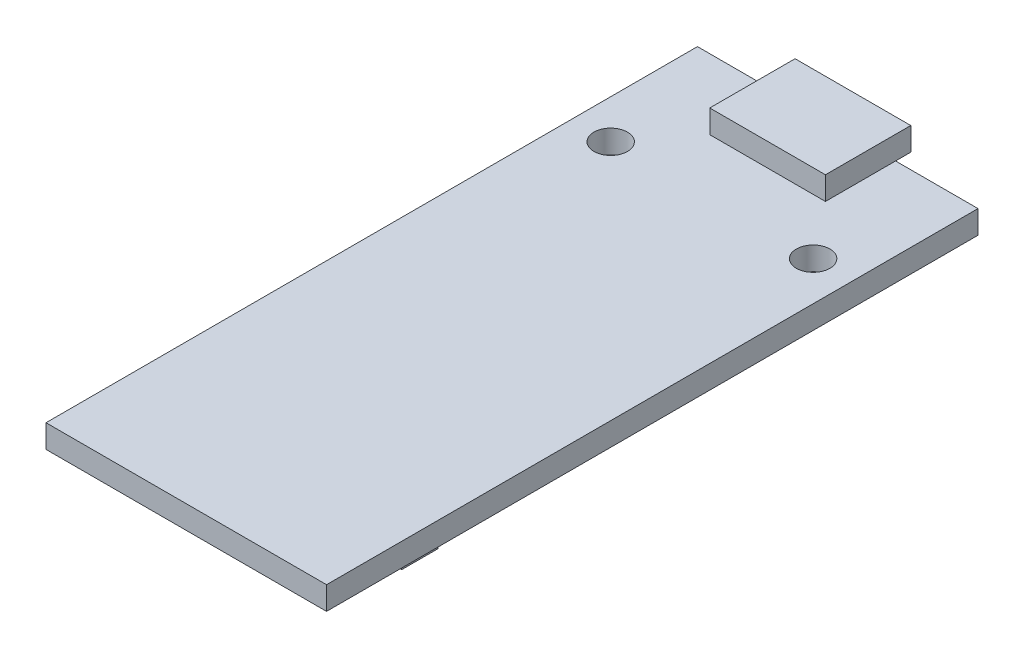
ISO-10303-21;
HEADER;
FILE_DESCRIPTION(('STEP AP214'),'2;1');
FILE_NAME('part.step','',(''),(''),'','','');
FILE_SCHEMA(('AUTOMOTIVE_DESIGN { 1 0 10303 214 1 1 1 1 }'));
ENDSEC;
DATA;
#1=APPLICATION_CONTEXT('core data for automotive mechanical design processes');
#2=APPLICATION_PROTOCOL_DEFINITION('international standard','automotive_design',2000,#1);
#3=PRODUCT_CONTEXT('',#1,'mechanical');
#4=PRODUCT('Part','Part','',(#3));
#5=PRODUCT_RELATED_PRODUCT_CATEGORY('part','',(#4));
#6=PRODUCT_DEFINITION_FORMATION('','',#4);
#7=PRODUCT_DEFINITION_CONTEXT('part definition',#1,'design');
#8=PRODUCT_DEFINITION('design','',#6,#7);
#9=PRODUCT_DEFINITION_SHAPE('','',#8);
#10=(LENGTH_UNIT() NAMED_UNIT(*) SI_UNIT(.MILLI.,.METRE.));
#11=(NAMED_UNIT(*) PLANE_ANGLE_UNIT() SI_UNIT($,.RADIAN.));
#12=(NAMED_UNIT(*) SI_UNIT($,.STERADIAN.) SOLID_ANGLE_UNIT());
#13=UNCERTAINTY_MEASURE_WITH_UNIT(LENGTH_MEASURE(1.E-05),#10,'distance_accuracy_value','');
#14=(GEOMETRIC_REPRESENTATION_CONTEXT(3) GLOBAL_UNCERTAINTY_ASSIGNED_CONTEXT((#13)) GLOBAL_UNIT_ASSIGNED_CONTEXT((#10,
#11,#12)) REPRESENTATION_CONTEXT('',''));
#15=CARTESIAN_POINT('',(0.,0.,0.));
#16=DIRECTION('',(0.,0.,1.));
#17=DIRECTION('',(1.,0.,0.));
#18=AXIS2_PLACEMENT_3D('',#15,#16,#17);
#19=CARTESIAN_POINT('',(0.,0.,0.));
#20=DIRECTION('',(0.,1.,0.));
#21=DIRECTION('',(0.,0.,1.));
#22=AXIS2_PLACEMENT_3D('',#19,#20,#21);
#23=PLANE('',#22);
#24=DIRECTION('',(0.,0.,-1.));
#25=VECTOR('',#24,1.);
#26=CARTESIAN_POINT('',(-17.9,0.,12.87));
#27=LINE('',#26,#25);
#28=CARTESIAN_POINT('',(-17.9,0.,15.37));
#29=VERTEX_POINT('',#28);
#30=CARTESIAN_POINT('',(-17.9,0.,12.87));
#31=VERTEX_POINT('',#30);
#32=EDGE_CURVE('E178',#29,#31,#27,.T.);
#33=ORIENTED_EDGE('',*,*,#32,.F.);
#34=DIRECTION('',(-1.,0.,0.));
#35=VECTOR('',#34,1.);
#36=CARTESIAN_POINT('',(-17.9,0.,15.37));
#37=LINE('',#36,#35);
#38=CARTESIAN_POINT('',(-10.65,0.,15.37));
#39=VERTEX_POINT('',#38);
#40=EDGE_CURVE('E191',#39,#29,#37,.T.);
#41=ORIENTED_EDGE('',*,*,#40,.F.);
#42=DIRECTION('',(0.,0.,1.));
#43=VECTOR('',#42,1.);
#44=CARTESIAN_POINT('',(-10.65,0.,12.87));
#45=LINE('',#44,#43);
#46=CARTESIAN_POINT('',(-10.65,0.,12.87));
#47=VERTEX_POINT('',#46);
#48=EDGE_CURVE('E200',#47,#39,#45,.T.);
#49=ORIENTED_EDGE('',*,*,#48,.F.);
#50=DIRECTION('',(1.,0.,0.));
#51=VECTOR('',#50,1.);
#52=CARTESIAN_POINT('',(-17.9,0.,12.87));
#53=LINE('',#52,#51);
#54=EDGE_CURVE('E181',#31,#47,#53,.T.);
#55=ORIENTED_EDGE('',*,*,#54,.F.);
#56=EDGE_LOOP('',(#33,#41,#49,#55));
#57=FACE_BOUND('',#56,.T.);
#58=CARTESIAN_POINT('',(-16.7,0.,8.7));
#59=DIRECTION('',(0.,1.,0.));
#60=DIRECTION('',(0.,0.,1.));
#61=AXIS2_PLACEMENT_3D('',#58,#59,#60);
#62=CIRCLE('',#61,1.16);
#63=CARTESIAN_POINT('',(-16.7,0.,9.86));
#64=VERTEX_POINT('',#63);
#65=EDGE_CURVE('E222',#64,#64,#62,.T.);
#66=ORIENTED_EDGE('',*,*,#65,.T.);
#67=EDGE_LOOP('',(#66));
#68=FACE_BOUND('',#67,.T.);
#69=DIRECTION('',(0.,0.,1.));
#70=VECTOR('',#69,1.);
#71=CARTESIAN_POINT('',(-19.4,0.,0.));
#72=LINE('',#71,#70);
#73=CARTESIAN_POINT('',(-19.4,0.,0.));
#74=VERTEX_POINT('',#73);
#75=CARTESIAN_POINT('',(-19.4,0.,45.05));
#76=VERTEX_POINT('',#75);
#77=EDGE_CURVE('E259',#74,#76,#72,.T.);
#78=ORIENTED_EDGE('',*,*,#77,.F.);
#79=DIRECTION('',(-1.,0.,0.));
#80=VECTOR('',#79,1.);
#81=CARTESIAN_POINT('',(-19.4,0.,0.));
#82=LINE('',#81,#80);
#83=CARTESIAN_POINT('',(0.,0.,0.));
#84=VERTEX_POINT('',#83);
#85=EDGE_CURVE('E264',#84,#74,#82,.T.);
#86=ORIENTED_EDGE('',*,*,#85,.F.);
#87=DIRECTION('',(0.,0.,-1.));
#88=VECTOR('',#87,1.);
#89=CARTESIAN_POINT('',(0.,0.,0.));
#90=LINE('',#89,#88);
#91=CARTESIAN_POINT('',(0.,0.,45.05));
#92=VERTEX_POINT('',#91);
#93=EDGE_CURVE('E278',#92,#84,#90,.T.);
#94=ORIENTED_EDGE('',*,*,#93,.F.);
#95=DIRECTION('',(1.,0.,0.));
#96=VECTOR('',#95,1.);
#97=CARTESIAN_POINT('',(-19.4,0.,45.05));
#98=LINE('',#97,#96);
#99=EDGE_CURVE('E276',#76,#92,#98,.T.);
#100=ORIENTED_EDGE('',*,*,#99,.F.);
#101=EDGE_LOOP('',(#78,#86,#94,#100));
#102=FACE_BOUND('',#101,.T.);
#103=CARTESIAN_POINT('',(-2.7,0.,8.7));
#104=DIRECTION('',(0.,1.,0.));
#105=DIRECTION('',(0.,0.,1.));
#106=AXIS2_PLACEMENT_3D('',#103,#104,#105);
#107=CIRCLE('',#106,1.16);
#108=CARTESIAN_POINT('',(-2.7,0.,9.86));
#109=VERTEX_POINT('',#108);
#110=EDGE_CURVE('E216',#109,#109,#107,.T.);
#111=ORIENTED_EDGE('',*,*,#110,.T.);
#112=EDGE_LOOP('',(#111));
#113=FACE_BOUND('',#112,.T.);
#114=DIRECTION('',(0.,0.,-1.));
#115=VECTOR('',#114,1.);
#116=CARTESIAN_POINT('',(-17.9,0.,35.8564320091546));
#117=LINE('',#116,#115);
#118=CARTESIAN_POINT('',(-17.9,0.,38.3564320091546));
#119=VERTEX_POINT('',#118);
#120=CARTESIAN_POINT('',(-17.9,0.,35.8564320091546));
#121=VERTEX_POINT('',#120);
#122=EDGE_CURVE('E177',#119,#121,#117,.T.);
#123=ORIENTED_EDGE('',*,*,#122,.F.);
#124=DIRECTION('',(-1.,0.,0.));
#125=VECTOR('',#124,1.);
#126=CARTESIAN_POINT('',(-17.9,0.,38.3564320091546));
#127=LINE('',#126,#125);
#128=CARTESIAN_POINT('',(-1.5,0.,38.3564320091546));
#129=VERTEX_POINT('',#128);
#130=EDGE_CURVE('E174',#129,#119,#127,.T.);
#131=ORIENTED_EDGE('',*,*,#130,.F.);
#132=DIRECTION('',(0.,0.,1.));
#133=VECTOR('',#132,1.);
#134=CARTESIAN_POINT('',(-1.5,0.,35.8564320091546));
#135=LINE('',#134,#133);
#136=CARTESIAN_POINT('',(-1.5,0.,35.8564320091546));
#137=VERTEX_POINT('',#136);
#138=EDGE_CURVE('E58',#137,#129,#135,.T.);
#139=ORIENTED_EDGE('',*,*,#138,.F.);
#140=DIRECTION('',(1.,0.,0.));
#141=VECTOR('',#140,1.);
#142=CARTESIAN_POINT('',(-17.9,0.,35.8564320091546));
#143=LINE('',#142,#141);
#144=EDGE_CURVE('E53',#121,#137,#143,.T.);
#145=ORIENTED_EDGE('',*,*,#144,.F.);
#146=EDGE_LOOP('',(#123,#131,#139,#145));
#147=FACE_BOUND('',#146,.T.);
#148=ADVANCED_FACE('F36',(#57,#68,#102,#113,#147),#23,.F.);
#149=CARTESIAN_POINT('',(0.,1.6,0.));
#150=DIRECTION('',(0.,1.,0.));
#151=DIRECTION('',(0.,0.,1.));
#152=AXIS2_PLACEMENT_3D('',#149,#150,#151);
#153=PLANE('',#152);
#154=CARTESIAN_POINT('',(-16.7,1.6,8.7));
#155=DIRECTION('',(0.,1.,0.));
#156=DIRECTION('',(0.,0.,1.));
#157=AXIS2_PLACEMENT_3D('',#154,#155,#156);
#158=CIRCLE('',#157,1.16);
#159=CARTESIAN_POINT('',(-16.7,1.6,9.86));
#160=VERTEX_POINT('',#159);
#161=EDGE_CURVE('E225',#160,#160,#158,.F.);
#162=ORIENTED_EDGE('',*,*,#161,.T.);
#163=EDGE_LOOP('',(#162));
#164=FACE_BOUND('',#163,.T.);
#165=DIRECTION('',(0.,0.,-1.));
#166=VECTOR('',#165,1.);
#167=CARTESIAN_POINT('',(-5.7,1.6,-1.05));
#168=LINE('',#167,#166);
#169=CARTESIAN_POINT('',(-5.7,1.6,4.85));
#170=VERTEX_POINT('',#169);
#171=CARTESIAN_POINT('',(-5.7,1.6,0.));
#172=VERTEX_POINT('',#171);
#173=EDGE_CURVE('E240',#170,#172,#168,.T.);
#174=ORIENTED_EDGE('',*,*,#173,.F.);
#175=DIRECTION('',(1.,0.,0.));
#176=VECTOR('',#175,1.);
#177=CARTESIAN_POINT('',(-5.7,1.6,4.85));
#178=LINE('',#177,#176);
#179=CARTESIAN_POINT('',(-13.7,1.6,4.85));
#180=VERTEX_POINT('',#179);
#181=EDGE_CURVE('E233',#180,#170,#178,.T.);
#182=ORIENTED_EDGE('',*,*,#181,.F.);
#183=DIRECTION('',(0.,0.,1.));
#184=VECTOR('',#183,1.);
#185=CARTESIAN_POINT('',(-13.7,1.6,-1.05));
#186=LINE('',#185,#184);
#187=CARTESIAN_POINT('',(-13.7,1.6,0.));
#188=VERTEX_POINT('',#187);
#189=EDGE_CURVE('E11',#188,#180,#186,.T.);
#190=ORIENTED_EDGE('',*,*,#189,.F.);
#191=DIRECTION('',(-1.,0.,0.));
#192=VECTOR('',#191,1.);
#193=CARTESIAN_POINT('',(-19.4,1.6,0.));
#194=LINE('',#193,#192);
#195=CARTESIAN_POINT('',(-19.4,1.6,0.));
#196=VERTEX_POINT('',#195);
#197=EDGE_CURVE('E268',#188,#196,#194,.T.);
#198=ORIENTED_EDGE('',*,*,#197,.T.);
#199=DIRECTION('',(0.,0.,1.));
#200=VECTOR('',#199,1.);
#201=CARTESIAN_POINT('',(-19.4,1.6,0.));
#202=LINE('',#201,#200);
#203=CARTESIAN_POINT('',(-19.4,1.6,45.05));
#204=VERTEX_POINT('',#203);
#205=EDGE_CURVE('E260',#196,#204,#202,.T.);
#206=ORIENTED_EDGE('',*,*,#205,.T.);
#207=DIRECTION('',(1.,0.,0.));
#208=VECTOR('',#207,1.);
#209=CARTESIAN_POINT('',(-19.4,1.6,45.05));
#210=LINE('',#209,#208);
#211=CARTESIAN_POINT('',(0.,1.6,45.05));
#212=VERTEX_POINT('',#211);
#213=EDGE_CURVE('E263',#204,#212,#210,.T.);
#214=ORIENTED_EDGE('',*,*,#213,.T.);
#215=DIRECTION('',(0.,0.,-1.));
#216=VECTOR('',#215,1.);
#217=CARTESIAN_POINT('',(0.,1.6,0.));
#218=LINE('',#217,#216);
#219=CARTESIAN_POINT('',(0.,1.6,0.));
#220=VERTEX_POINT('',#219);
#221=EDGE_CURVE('E266',#212,#220,#218,.T.);
#222=ORIENTED_EDGE('',*,*,#221,.T.);
#223=EDGE_CURVE('E269',#220,#172,#194,.T.);
#224=ORIENTED_EDGE('',*,*,#223,.T.);
#225=EDGE_LOOP('',(#174,#182,#190,#198,#206,#214,#222,#224));
#226=FACE_BOUND('',#225,.T.);
#227=CARTESIAN_POINT('',(-2.7,1.6,8.7));
#228=DIRECTION('',(0.,1.,0.));
#229=DIRECTION('',(0.,0.,1.));
#230=AXIS2_PLACEMENT_3D('',#227,#228,#229);
#231=CIRCLE('',#230,1.16);
#232=CARTESIAN_POINT('',(-2.7,1.6,9.86));
#233=VERTEX_POINT('',#232);
#234=EDGE_CURVE('E219',#233,#233,#231,.F.);
#235=ORIENTED_EDGE('',*,*,#234,.T.);
#236=EDGE_LOOP('',(#235));
#237=FACE_BOUND('',#236,.T.);
#238=ADVANCED_FACE('F311',(#164,#226,#237),#153,.T.);
#239=CARTESIAN_POINT('',(-19.4,1.6,0.));
#240=DIRECTION('',(1.,0.,0.));
#241=DIRECTION('',(0.,0.,-1.));
#242=AXIS2_PLACEMENT_3D('',#239,#240,#241);
#243=PLANE('',#242);
#244=ORIENTED_EDGE('',*,*,#77,.T.);
#245=DIRECTION('',(0.,-1.,0.));
#246=VECTOR('',#245,1.);
#247=CARTESIAN_POINT('',(-19.4,1.6,45.05));
#248=LINE('',#247,#246);
#249=EDGE_CURVE('E40',#204,#76,#248,.T.);
#250=ORIENTED_EDGE('',*,*,#249,.F.);
#251=ORIENTED_EDGE('',*,*,#205,.F.);
#252=DIRECTION('',(0.,-1.,0.));
#253=VECTOR('',#252,1.);
#254=CARTESIAN_POINT('',(-19.4,1.6,0.));
#255=LINE('',#254,#253);
#256=EDGE_CURVE('E272',#196,#74,#255,.T.);
#257=ORIENTED_EDGE('',*,*,#256,.T.);
#258=EDGE_LOOP('',(#244,#250,#251,#257));
#259=FACE_BOUND('',#258,.T.);
#260=ADVANCED_FACE('F38',(#259),#243,.F.);
#261=CARTESIAN_POINT('',(-19.4,1.6,45.05));
#262=DIRECTION('',(0.,0.,-1.));
#263=DIRECTION('',(-1.,0.,0.));
#264=AXIS2_PLACEMENT_3D('',#261,#262,#263);
#265=PLANE('',#264);
#266=ORIENTED_EDGE('',*,*,#99,.T.);
#267=DIRECTION('',(0.,-1.,0.));
#268=VECTOR('',#267,1.);
#269=CARTESIAN_POINT('',(0.,1.6,45.05));
#270=LINE('',#269,#268);
#271=EDGE_CURVE('E285',#212,#92,#270,.T.);
#272=ORIENTED_EDGE('',*,*,#271,.F.);
#273=ORIENTED_EDGE('',*,*,#213,.F.);
#274=ORIENTED_EDGE('',*,*,#249,.T.);
#275=EDGE_LOOP('',(#266,#272,#273,#274));
#276=FACE_BOUND('',#275,.T.);
#277=ADVANCED_FACE('F294',(#276),#265,.F.);
#278=CARTESIAN_POINT('',(0.,1.6,0.));
#279=DIRECTION('',(-1.,0.,0.));
#280=DIRECTION('',(0.,0.,1.));
#281=AXIS2_PLACEMENT_3D('',#278,#279,#280);
#282=PLANE('',#281);
#283=ORIENTED_EDGE('',*,*,#93,.T.);
#284=DIRECTION('',(0.,-1.,0.));
#285=VECTOR('',#284,1.);
#286=CARTESIAN_POINT('',(0.,1.6,0.));
#287=LINE('',#286,#285);
#288=EDGE_CURVE('E283',#220,#84,#287,.T.);
#289=ORIENTED_EDGE('',*,*,#288,.F.);
#290=ORIENTED_EDGE('',*,*,#221,.F.);
#291=ORIENTED_EDGE('',*,*,#271,.T.);
#292=EDGE_LOOP('',(#283,#289,#290,#291));
#293=FACE_BOUND('',#292,.T.);
#294=ADVANCED_FACE('F303',(#293),#282,.F.);
#295=CARTESIAN_POINT('',(-19.4,1.6,0.));
#296=DIRECTION('',(0.,0.,1.));
#297=DIRECTION('',(1.,0.,0.));
#298=AXIS2_PLACEMENT_3D('',#295,#296,#297);
#299=PLANE('',#298);
#300=ORIENTED_EDGE('',*,*,#85,.T.);
#301=ORIENTED_EDGE('',*,*,#256,.F.);
#302=ORIENTED_EDGE('',*,*,#197,.F.);
#303=EDGE_CURVE('E273',#172,#188,#194,.T.);
#304=ORIENTED_EDGE('',*,*,#303,.F.);
#305=ORIENTED_EDGE('',*,*,#223,.F.);
#306=ORIENTED_EDGE('',*,*,#288,.T.);
#307=EDGE_LOOP('',(#300,#301,#302,#304,#305,#306));
#308=FACE_BOUND('',#307,.T.);
#309=ADVANCED_FACE('F306',(#308),#299,.F.);
#310=CARTESIAN_POINT('',(-5.7,3.2,-1.05));
#311=DIRECTION('',(-1.,0.,0.));
#312=DIRECTION('',(0.,0.,1.));
#313=AXIS2_PLACEMENT_3D('',#310,#311,#312);
#314=PLANE('',#313);
#315=ORIENTED_EDGE('',*,*,#173,.T.);
#316=CARTESIAN_POINT('',(-5.7,1.6,-1.05));
#317=VERTEX_POINT('',#316);
#318=EDGE_CURVE('E228',#172,#317,#168,.T.);
#319=ORIENTED_EDGE('',*,*,#318,.T.);
#320=DIRECTION('',(0.,-1.,0.));
#321=VECTOR('',#320,1.);
#322=CARTESIAN_POINT('',(-5.7,3.2,-1.05));
#323=LINE('',#322,#321);
#324=CARTESIAN_POINT('',(-5.7,3.2,-1.05));
#325=VERTEX_POINT('',#324);
#326=EDGE_CURVE('E256',#325,#317,#323,.T.);
#327=ORIENTED_EDGE('',*,*,#326,.F.);
#328=DIRECTION('',(0.,0.,-1.));
#329=VECTOR('',#328,1.);
#330=CARTESIAN_POINT('',(-5.7,3.2,-1.05));
#331=LINE('',#330,#329);
#332=CARTESIAN_POINT('',(-5.7,3.2,4.85));
#333=VERTEX_POINT('',#332);
#334=EDGE_CURVE('E229',#333,#325,#331,.T.);
#335=ORIENTED_EDGE('',*,*,#334,.F.);
#336=DIRECTION('',(0.,-1.,0.));
#337=VECTOR('',#336,1.);
#338=CARTESIAN_POINT('',(-5.7,3.2,4.85));
#339=LINE('',#338,#337);
#340=EDGE_CURVE('E239',#333,#170,#339,.T.);
#341=ORIENTED_EDGE('',*,*,#340,.T.);
#342=EDGE_LOOP('',(#315,#319,#327,#335,#341));
#343=FACE_BOUND('',#342,.T.);
#344=ADVANCED_FACE('F319',(#343),#314,.F.);
#345=CARTESIAN_POINT('',(-5.7,3.2,-1.05));
#346=DIRECTION('',(0.,0.,1.));
#347=DIRECTION('',(1.,0.,0.));
#348=AXIS2_PLACEMENT_3D('',#345,#346,#347);
#349=PLANE('',#348);
#350=DIRECTION('',(-1.,0.,0.));
#351=VECTOR('',#350,1.);
#352=CARTESIAN_POINT('',(-5.7,1.6,-1.05));
#353=LINE('',#352,#351);
#354=CARTESIAN_POINT('',(-13.7,1.6,-1.05));
#355=VERTEX_POINT('',#354);
#356=EDGE_CURVE('E243',#317,#355,#353,.T.);
#357=ORIENTED_EDGE('',*,*,#356,.T.);
#358=DIRECTION('',(0.,-1.,0.));
#359=VECTOR('',#358,1.);
#360=CARTESIAN_POINT('',(-13.7,3.2,-1.05));
#361=LINE('',#360,#359);
#362=CARTESIAN_POINT('',(-13.7,3.2,-1.05));
#363=VERTEX_POINT('',#362);
#364=EDGE_CURVE('E253',#363,#355,#361,.T.);
#365=ORIENTED_EDGE('',*,*,#364,.F.);
#366=DIRECTION('',(-1.,0.,0.));
#367=VECTOR('',#366,1.);
#368=CARTESIAN_POINT('',(-5.7,3.2,-1.05));
#369=LINE('',#368,#367);
#370=EDGE_CURVE('E232',#325,#363,#369,.T.);
#371=ORIENTED_EDGE('',*,*,#370,.F.);
#372=ORIENTED_EDGE('',*,*,#326,.T.);
#373=EDGE_LOOP('',(#357,#365,#371,#372));
#374=FACE_BOUND('',#373,.T.);
#375=ADVANCED_FACE('F331',(#374),#349,.F.);
#376=CARTESIAN_POINT('',(-13.7,3.2,-1.05));
#377=DIRECTION('',(1.,0.,0.));
#378=DIRECTION('',(0.,0.,-1.));
#379=AXIS2_PLACEMENT_3D('',#376,#377,#378);
#380=PLANE('',#379);
#381=EDGE_CURVE('E46',#355,#188,#186,.T.);
#382=ORIENTED_EDGE('',*,*,#381,.T.);
#383=ORIENTED_EDGE('',*,*,#189,.T.);
#384=DIRECTION('',(0.,-1.,0.));
#385=VECTOR('',#384,1.);
#386=CARTESIAN_POINT('',(-13.7,3.2,4.85));
#387=LINE('',#386,#385);
#388=CARTESIAN_POINT('',(-13.7,3.2,4.85));
#389=VERTEX_POINT('',#388);
#390=EDGE_CURVE('E250',#389,#180,#387,.T.);
#391=ORIENTED_EDGE('',*,*,#390,.F.);
#392=DIRECTION('',(0.,0.,1.));
#393=VECTOR('',#392,1.);
#394=CARTESIAN_POINT('',(-13.7,3.2,-1.05));
#395=LINE('',#394,#393);
#396=EDGE_CURVE('E235',#363,#389,#395,.T.);
#397=ORIENTED_EDGE('',*,*,#396,.F.);
#398=ORIENTED_EDGE('',*,*,#364,.T.);
#399=EDGE_LOOP('',(#382,#383,#391,#397,#398));
#400=FACE_BOUND('',#399,.T.);
#401=ADVANCED_FACE('F327',(#400),#380,.F.);
#402=CARTESIAN_POINT('',(-5.7,3.2,4.85));
#403=DIRECTION('',(0.,0.,-1.));
#404=DIRECTION('',(-1.,0.,0.));
#405=AXIS2_PLACEMENT_3D('',#402,#403,#404);
#406=PLANE('',#405);
#407=ORIENTED_EDGE('',*,*,#181,.T.);
#408=ORIENTED_EDGE('',*,*,#340,.F.);
#409=DIRECTION('',(1.,0.,0.));
#410=VECTOR('',#409,1.);
#411=CARTESIAN_POINT('',(-5.7,3.2,4.85));
#412=LINE('',#411,#410);
#413=EDGE_CURVE('E237',#389,#333,#412,.T.);
#414=ORIENTED_EDGE('',*,*,#413,.F.);
#415=ORIENTED_EDGE('',*,*,#390,.T.);
#416=EDGE_LOOP('',(#407,#408,#414,#415));
#417=FACE_BOUND('',#416,.T.);
#418=ADVANCED_FACE('F324',(#417),#406,.F.);
#419=CARTESIAN_POINT('',(0.,3.2,0.));
#420=DIRECTION('',(0.,-1.,0.));
#421=DIRECTION('',(0.,0.,-1.));
#422=AXIS2_PLACEMENT_3D('',#419,#420,#421);
#423=PLANE('',#422);
#424=ORIENTED_EDGE('',*,*,#334,.T.);
#425=ORIENTED_EDGE('',*,*,#370,.T.);
#426=ORIENTED_EDGE('',*,*,#396,.T.);
#427=ORIENTED_EDGE('',*,*,#413,.T.);
#428=EDGE_LOOP('',(#424,#425,#426,#427));
#429=FACE_BOUND('',#428,.T.);
#430=ADVANCED_FACE('F333',(#429),#423,.F.);
#431=CARTESIAN_POINT('',(0.,1.6,0.));
#432=DIRECTION('',(0.,-1.,0.));
#433=DIRECTION('',(0.,0.,-1.));
#434=AXIS2_PLACEMENT_3D('',#431,#432,#433);
#435=PLANE('',#434);
#436=ORIENTED_EDGE('',*,*,#318,.F.);
#437=ORIENTED_EDGE('',*,*,#303,.T.);
#438=ORIENTED_EDGE('',*,*,#381,.F.);
#439=ORIENTED_EDGE('',*,*,#356,.F.);
#440=EDGE_LOOP('',(#436,#437,#438,#439));
#441=FACE_BOUND('',#440,.T.);
#442=ADVANCED_FACE('F315',(#441),#435,.T.);
#443=CARTESIAN_POINT('',(-16.7,3.2,8.7));
#444=DIRECTION('',(0.,-1.,0.));
#445=DIRECTION('',(0.,0.,-1.));
#446=AXIS2_PLACEMENT_3D('',#443,#444,#445);
#447=CYLINDRICAL_SURFACE('',#446,1.16);
#448=ORIENTED_EDGE('',*,*,#161,.F.);
#449=EDGE_LOOP('',(#448));
#450=FACE_BOUND('',#449,.T.);
#451=ORIENTED_EDGE('',*,*,#65,.F.);
#452=EDGE_LOOP('',(#451));
#453=FACE_BOUND('',#452,.T.);
#454=ADVANCED_FACE('F340',(#450,#453),#447,.F.);
#455=CARTESIAN_POINT('',(-2.7,3.2,8.7));
#456=DIRECTION('',(0.,-1.,0.));
#457=DIRECTION('',(0.,0.,-1.));
#458=AXIS2_PLACEMENT_3D('',#455,#456,#457);
#459=CYLINDRICAL_SURFACE('',#458,1.16);
#460=ORIENTED_EDGE('',*,*,#234,.F.);
#461=EDGE_LOOP('',(#460));
#462=FACE_BOUND('',#461,.T.);
#463=ORIENTED_EDGE('',*,*,#110,.F.);
#464=EDGE_LOOP('',(#463));
#465=FACE_BOUND('',#464,.T.);
#466=ADVANCED_FACE('F380',(#462,#465),#459,.F.);
#467=CARTESIAN_POINT('',(-17.9,-1.6,12.87));
#468=DIRECTION('',(1.,0.,0.));
#469=DIRECTION('',(0.,0.,-1.));
#470=AXIS2_PLACEMENT_3D('',#467,#468,#469);
#471=PLANE('',#470);
#472=ORIENTED_EDGE('',*,*,#32,.T.);
#473=DIRECTION('',(0.,1.,0.));
#474=VECTOR('',#473,1.);
#475=CARTESIAN_POINT('',(-17.9,-1.6,12.87));
#476=LINE('',#475,#474);
#477=CARTESIAN_POINT('',(-17.9,-1.6,12.87));
#478=VERTEX_POINT('',#477);
#479=EDGE_CURVE('E213',#478,#31,#476,.T.);
#480=ORIENTED_EDGE('',*,*,#479,.F.);
#481=DIRECTION('',(0.,0.,-1.));
#482=VECTOR('',#481,1.);
#483=CARTESIAN_POINT('',(-17.9,-1.6,12.87));
#484=LINE('',#483,#482);
#485=CARTESIAN_POINT('',(-17.9,-1.6,15.37));
#486=VERTEX_POINT('',#485);
#487=EDGE_CURVE('E187',#486,#478,#484,.T.);
#488=ORIENTED_EDGE('',*,*,#487,.F.);
#489=DIRECTION('',(0.,1.,0.));
#490=VECTOR('',#489,1.);
#491=CARTESIAN_POINT('',(-17.9,-1.6,15.37));
#492=LINE('',#491,#490);
#493=EDGE_CURVE('E196',#486,#29,#492,.T.);
#494=ORIENTED_EDGE('',*,*,#493,.T.);
#495=EDGE_LOOP('',(#472,#480,#488,#494));
#496=FACE_BOUND('',#495,.T.);
#497=ADVANCED_FACE('F388',(#496),#471,.F.);
#498=CARTESIAN_POINT('',(-17.9,-1.6,12.87));
#499=DIRECTION('',(0.,0.,1.));
#500=DIRECTION('',(1.,0.,0.));
#501=AXIS2_PLACEMENT_3D('',#498,#499,#500);
#502=PLANE('',#501);
#503=ORIENTED_EDGE('',*,*,#54,.T.);
#504=DIRECTION('',(0.,1.,0.));
#505=VECTOR('',#504,1.);
#506=CARTESIAN_POINT('',(-10.65,-1.6,12.87));
#507=LINE('',#506,#505);
#508=CARTESIAN_POINT('',(-10.65,-1.6,12.87));
#509=VERTEX_POINT('',#508);
#510=EDGE_CURVE('E210',#509,#47,#507,.T.);
#511=ORIENTED_EDGE('',*,*,#510,.F.);
#512=DIRECTION('',(1.,0.,0.));
#513=VECTOR('',#512,1.);
#514=CARTESIAN_POINT('',(-17.9,-1.6,12.87));
#515=LINE('',#514,#513);
#516=EDGE_CURVE('E190',#478,#509,#515,.T.);
#517=ORIENTED_EDGE('',*,*,#516,.F.);
#518=ORIENTED_EDGE('',*,*,#479,.T.);
#519=EDGE_LOOP('',(#503,#511,#517,#518));
#520=FACE_BOUND('',#519,.T.);
#521=ADVANCED_FACE('F403',(#520),#502,.F.);
#522=CARTESIAN_POINT('',(-10.65,-1.6,12.87));
#523=DIRECTION('',(-1.,0.,0.));
#524=DIRECTION('',(0.,0.,1.));
#525=AXIS2_PLACEMENT_3D('',#522,#523,#524);
#526=PLANE('',#525);
#527=ORIENTED_EDGE('',*,*,#48,.T.);
#528=DIRECTION('',(0.,1.,0.));
#529=VECTOR('',#528,1.);
#530=CARTESIAN_POINT('',(-10.65,-1.6,15.37));
#531=LINE('',#530,#529);
#532=CARTESIAN_POINT('',(-10.65,-1.6,15.37));
#533=VERTEX_POINT('',#532);
#534=EDGE_CURVE('E207',#533,#39,#531,.T.);
#535=ORIENTED_EDGE('',*,*,#534,.F.);
#536=DIRECTION('',(0.,0.,1.));
#537=VECTOR('',#536,1.);
#538=CARTESIAN_POINT('',(-10.65,-1.6,12.87));
#539=LINE('',#538,#537);
#540=EDGE_CURVE('E193',#509,#533,#539,.T.);
#541=ORIENTED_EDGE('',*,*,#540,.F.);
#542=ORIENTED_EDGE('',*,*,#510,.T.);
#543=EDGE_LOOP('',(#527,#535,#541,#542));
#544=FACE_BOUND('',#543,.T.);
#545=ADVANCED_FACE('F413',(#544),#526,.F.);
#546=CARTESIAN_POINT('',(-17.9,-1.6,15.37));
#547=DIRECTION('',(0.,0.,-1.));
#548=DIRECTION('',(-1.,0.,0.));
#549=AXIS2_PLACEMENT_3D('',#546,#547,#548);
#550=PLANE('',#549);
#551=ORIENTED_EDGE('',*,*,#40,.T.);
#552=ORIENTED_EDGE('',*,*,#493,.F.);
#553=DIRECTION('',(-1.,0.,0.));
#554=VECTOR('',#553,1.);
#555=CARTESIAN_POINT('',(-17.9,-1.6,15.37));
#556=LINE('',#555,#554);
#557=EDGE_CURVE('E195',#533,#486,#556,.T.);
#558=ORIENTED_EDGE('',*,*,#557,.F.);
#559=ORIENTED_EDGE('',*,*,#534,.T.);
#560=EDGE_LOOP('',(#551,#552,#558,#559));
#561=FACE_BOUND('',#560,.T.);
#562=ADVANCED_FACE('F423',(#561),#550,.F.);
#563=CARTESIAN_POINT('',(0.,-1.6,0.));
#564=DIRECTION('',(0.,1.,0.));
#565=DIRECTION('',(0.,0.,1.));
#566=AXIS2_PLACEMENT_3D('',#563,#564,#565);
#567=PLANE('',#566);
#568=ORIENTED_EDGE('',*,*,#487,.T.);
#569=ORIENTED_EDGE('',*,*,#516,.T.);
#570=ORIENTED_EDGE('',*,*,#540,.T.);
#571=ORIENTED_EDGE('',*,*,#557,.T.);
#572=EDGE_LOOP('',(#568,#569,#570,#571));
#573=FACE_BOUND('',#572,.T.);
#574=ADVANCED_FACE('F433',(#573),#567,.F.);
#575=CARTESIAN_POINT('',(-17.9,-1.6,35.8564320091546));
#576=DIRECTION('',(1.,0.,0.));
#577=DIRECTION('',(0.,0.,-1.));
#578=AXIS2_PLACEMENT_3D('',#575,#576,#577);
#579=PLANE('',#578);
#580=ORIENTED_EDGE('',*,*,#122,.T.);
#581=DIRECTION('',(0.,1.,0.));
#582=VECTOR('',#581,1.);
#583=CARTESIAN_POINT('',(-17.9,-1.6,35.8564320091546));
#584=LINE('',#583,#582);
#585=CARTESIAN_POINT('',(-17.9,-1.6,35.8564320091546));
#586=VERTEX_POINT('',#585);
#587=EDGE_CURVE('E158',#586,#121,#584,.T.);
#588=ORIENTED_EDGE('',*,*,#587,.F.);
#589=DIRECTION('',(0.,0.,-1.));
#590=VECTOR('',#589,1.);
#591=CARTESIAN_POINT('',(-17.9,-1.6,35.8564320091546));
#592=LINE('',#591,#590);
#593=CARTESIAN_POINT('',(-17.9,-1.6,38.3564320091546));
#594=VERTEX_POINT('',#593);
#595=EDGE_CURVE('E165',#594,#586,#592,.T.);
#596=ORIENTED_EDGE('',*,*,#595,.F.);
#597=DIRECTION('',(0.,1.,0.));
#598=VECTOR('',#597,1.);
#599=CARTESIAN_POINT('',(-17.9,-1.6,38.3564320091546));
#600=LINE('',#599,#598);
#601=EDGE_CURVE('E493',#594,#119,#600,.T.);
#602=ORIENTED_EDGE('',*,*,#601,.T.);
#603=EDGE_LOOP('',(#580,#588,#596,#602));
#604=FACE_BOUND('',#603,.T.);
#605=ADVANCED_FACE('F176',(#604),#579,.F.);
#606=CARTESIAN_POINT('',(-17.9,-1.6,35.8564320091546));
#607=DIRECTION('',(0.,0.,1.));
#608=DIRECTION('',(1.,0.,0.));
#609=AXIS2_PLACEMENT_3D('',#606,#607,#608);
#610=PLANE('',#609);
#611=ORIENTED_EDGE('',*,*,#144,.T.);
#612=DIRECTION('',(0.,1.,0.));
#613=VECTOR('',#612,1.);
#614=CARTESIAN_POINT('',(-1.5,-1.6,35.8564320091546));
#615=LINE('',#614,#613);
#616=CARTESIAN_POINT('',(-1.5,-1.6,35.8564320091546));
#617=VERTEX_POINT('',#616);
#618=EDGE_CURVE('E161',#617,#137,#615,.T.);
#619=ORIENTED_EDGE('',*,*,#618,.F.);
#620=DIRECTION('',(1.,0.,0.));
#621=VECTOR('',#620,1.);
#622=CARTESIAN_POINT('',(-17.9,-1.6,35.8564320091546));
#623=LINE('',#622,#621);
#624=EDGE_CURVE('E154',#586,#617,#623,.T.);
#625=ORIENTED_EDGE('',*,*,#624,.F.);
#626=ORIENTED_EDGE('',*,*,#587,.T.);
#627=EDGE_LOOP('',(#611,#619,#625,#626));
#628=FACE_BOUND('',#627,.T.);
#629=ADVANCED_FACE('F156',(#628),#610,.F.);
#630=CARTESIAN_POINT('',(-1.5,-1.6,35.8564320091546));
#631=DIRECTION('',(-1.,0.,0.));
#632=DIRECTION('',(0.,0.,1.));
#633=AXIS2_PLACEMENT_3D('',#630,#631,#632);
#634=PLANE('',#633);
#635=ORIENTED_EDGE('',*,*,#138,.T.);
#636=DIRECTION('',(0.,1.,0.));
#637=VECTOR('',#636,1.);
#638=CARTESIAN_POINT('',(-1.5,-1.6,38.3564320091546));
#639=LINE('',#638,#637);
#640=CARTESIAN_POINT('',(-1.5,-1.6,38.3564320091546));
#641=VERTEX_POINT('',#640);
#642=EDGE_CURVE('E183',#641,#129,#639,.T.);
#643=ORIENTED_EDGE('',*,*,#642,.F.);
#644=DIRECTION('',(0.,0.,1.));
#645=VECTOR('',#644,1.);
#646=CARTESIAN_POINT('',(-1.5,-1.6,35.8564320091546));
#647=LINE('',#646,#645);
#648=EDGE_CURVE('E164',#617,#641,#647,.T.);
#649=ORIENTED_EDGE('',*,*,#648,.F.);
#650=ORIENTED_EDGE('',*,*,#618,.T.);
#651=EDGE_LOOP('',(#635,#643,#649,#650));
#652=FACE_BOUND('',#651,.T.);
#653=ADVANCED_FACE('F460',(#652),#634,.F.);
#654=CARTESIAN_POINT('',(-17.9,-1.6,38.3564320091546));
#655=DIRECTION('',(0.,0.,-1.));
#656=DIRECTION('',(-1.,0.,0.));
#657=AXIS2_PLACEMENT_3D('',#654,#655,#656);
#658=PLANE('',#657);
#659=ORIENTED_EDGE('',*,*,#130,.T.);
#660=ORIENTED_EDGE('',*,*,#601,.F.);
#661=DIRECTION('',(-1.,0.,0.));
#662=VECTOR('',#661,1.);
#663=CARTESIAN_POINT('',(-17.9,-1.6,38.3564320091546));
#664=LINE('',#663,#662);
#665=EDGE_CURVE('E170',#641,#594,#664,.T.);
#666=ORIENTED_EDGE('',*,*,#665,.F.);
#667=ORIENTED_EDGE('',*,*,#642,.T.);
#668=EDGE_LOOP('',(#659,#660,#666,#667));
#669=FACE_BOUND('',#668,.T.);
#670=ADVANCED_FACE('F469',(#669),#658,.F.);
#671=CARTESIAN_POINT('',(0.,-1.6,0.));
#672=DIRECTION('',(0.,1.,0.));
#673=DIRECTION('',(0.,0.,1.));
#674=AXIS2_PLACEMENT_3D('',#671,#672,#673);
#675=PLANE('',#674);
#676=ORIENTED_EDGE('',*,*,#595,.T.);
#677=ORIENTED_EDGE('',*,*,#624,.T.);
#678=ORIENTED_EDGE('',*,*,#648,.T.);
#679=ORIENTED_EDGE('',*,*,#665,.T.);
#680=EDGE_LOOP('',(#676,#677,#678,#679));
#681=FACE_BOUND('',#680,.T.);
#682=ADVANCED_FACE('F168',(#681),#675,.F.);
#683=CLOSED_SHELL('',(#148,#238,#260,#277,#294,#309,#344,#375,#401,#418,#430,#442,#454,#466,
#497,#521,#545,#562,#574,#605,#629,#653,#670,#682));
#684=MANIFOLD_SOLID_BREP('B2',#683);
#685=ADVANCED_BREP_SHAPE_REPRESENTATION('',(#18,#684),#14);
#686=SHAPE_DEFINITION_REPRESENTATION(#9,#685);
ENDSEC;
END-ISO-10303-21;
